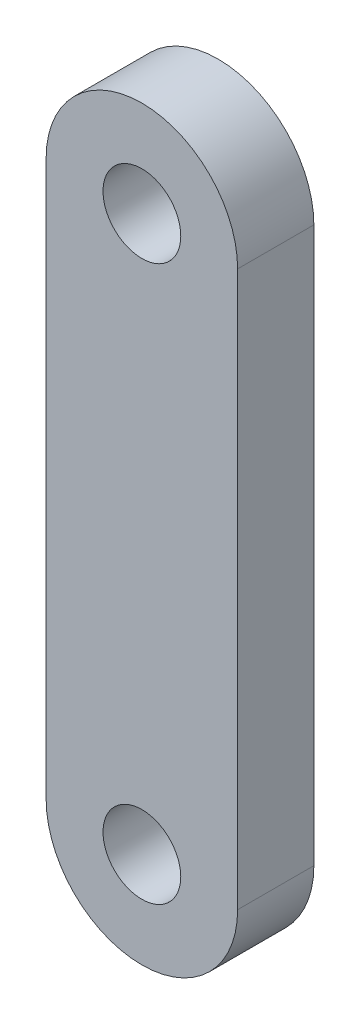
ISO-10303-21;
HEADER;
FILE_DESCRIPTION(('STEP AP214'),'2;1');
FILE_NAME('part.step','',(''),(''),'','','');
FILE_SCHEMA(('AUTOMOTIVE_DESIGN { 1 0 10303 214 1 1 1 1 }'));
ENDSEC;
DATA;
#1=APPLICATION_CONTEXT('core data for automotive mechanical design processes');
#2=APPLICATION_PROTOCOL_DEFINITION('international standard','automotive_design',2000,#1);
#3=PRODUCT_CONTEXT('',#1,'mechanical');
#4=PRODUCT('Part','Part','',(#3));
#5=PRODUCT_RELATED_PRODUCT_CATEGORY('part','',(#4));
#6=PRODUCT_DEFINITION_FORMATION('','',#4);
#7=PRODUCT_DEFINITION_CONTEXT('part definition',#1,'design');
#8=PRODUCT_DEFINITION('design','',#6,#7);
#9=PRODUCT_DEFINITION_SHAPE('','',#8);
#10=(LENGTH_UNIT() NAMED_UNIT(*) SI_UNIT(.MILLI.,.METRE.));
#11=(NAMED_UNIT(*) PLANE_ANGLE_UNIT() SI_UNIT($,.RADIAN.));
#12=(NAMED_UNIT(*) SI_UNIT($,.STERADIAN.) SOLID_ANGLE_UNIT());
#13=UNCERTAINTY_MEASURE_WITH_UNIT(LENGTH_MEASURE(1.E-05),#10,'distance_accuracy_value','');
#14=(GEOMETRIC_REPRESENTATION_CONTEXT(3) GLOBAL_UNCERTAINTY_ASSIGNED_CONTEXT((#13)) GLOBAL_UNIT_ASSIGNED_CONTEXT((#10,
#11,#12)) REPRESENTATION_CONTEXT('',''));
#15=CARTESIAN_POINT('',(0.,0.,0.));
#16=DIRECTION('',(0.,0.,1.));
#17=DIRECTION('',(1.,0.,0.));
#18=AXIS2_PLACEMENT_3D('',#15,#16,#17);
#19=CARTESIAN_POINT('',(0.,23.114,6.35));
#20=DIRECTION('',(0.,0.,1.));
#21=DIRECTION('',(1.,0.,0.));
#22=AXIS2_PLACEMENT_3D('',#19,#20,#21);
#23=PLANE('',#22);
#24=CARTESIAN_POINT('',(0.,23.114,6.35));
#25=DIRECTION('',(0.,0.,1.));
#26=DIRECTION('',(1.,0.,0.));
#27=AXIS2_PLACEMENT_3D('',#24,#25,#26);
#28=CIRCLE('',#27,3.2385);
#29=CARTESIAN_POINT('',(3.23849999999999,23.114,6.35));
#30=VERTEX_POINT('',#29);
#31=EDGE_CURVE('E99',#30,#30,#28,.T.);
#32=ORIENTED_EDGE('',*,*,#31,.F.);
#33=EDGE_LOOP('',(#32));
#34=FACE_BOUND('',#33,.T.);
#35=CARTESIAN_POINT('',(0.,23.114,6.35));
#36=DIRECTION('',(0.,0.,1.));
#37=DIRECTION('',(1.,0.,0.));
#38=AXIS2_PLACEMENT_3D('',#35,#36,#37);
#39=CIRCLE('',#38,7.9756);
#40=CARTESIAN_POINT('',(7.97559999999999,23.114,6.35));
#41=VERTEX_POINT('',#40);
#42=CARTESIAN_POINT('',(-7.97560000000001,23.114,6.35));
#43=VERTEX_POINT('',#42);
#44=EDGE_CURVE('E84',#41,#43,#39,.T.);
#45=ORIENTED_EDGE('',*,*,#44,.T.);
#46=DIRECTION('',(0.,-1.,0.));
#47=VECTOR('',#46,1.);
#48=CARTESIAN_POINT('',(-7.97560000000001,23.114,6.35));
#49=LINE('',#48,#47);
#50=CARTESIAN_POINT('',(-7.97559999999999,-23.114,6.35));
#51=VERTEX_POINT('',#50);
#52=EDGE_CURVE('E79',#43,#51,#49,.T.);
#53=ORIENTED_EDGE('',*,*,#52,.T.);
#54=CARTESIAN_POINT('',(0.,-23.114,6.35));
#55=DIRECTION('',(0.,0.,1.));
#56=DIRECTION('',(1.,0.,0.));
#57=AXIS2_PLACEMENT_3D('',#54,#55,#56);
#58=CIRCLE('',#57,7.9756);
#59=CARTESIAN_POINT('',(7.97560000000001,-23.114,6.35));
#60=VERTEX_POINT('',#59);
#61=EDGE_CURVE('E82',#51,#60,#58,.T.);
#62=ORIENTED_EDGE('',*,*,#61,.T.);
#63=DIRECTION('',(0.,1.,0.));
#64=VECTOR('',#63,1.);
#65=CARTESIAN_POINT('',(7.97559999999999,23.114,6.35));
#66=LINE('',#65,#64);
#67=EDGE_CURVE('E49',#60,#41,#66,.T.);
#68=ORIENTED_EDGE('',*,*,#67,.T.);
#69=EDGE_LOOP('',(#45,#53,#62,#68));
#70=FACE_BOUND('',#69,.T.);
#71=CARTESIAN_POINT('',(0.,-23.114,6.35));
#72=DIRECTION('',(0.,0.,1.));
#73=DIRECTION('',(1.,0.,0.));
#74=AXIS2_PLACEMENT_3D('',#71,#72,#73);
#75=CIRCLE('',#74,3.2385);
#76=CARTESIAN_POINT('',(3.23850000000001,-23.114,6.35));
#77=VERTEX_POINT('',#76);
#78=EDGE_CURVE('E114',#77,#77,#75,.T.);
#79=ORIENTED_EDGE('',*,*,#78,.F.);
#80=EDGE_LOOP('',(#79));
#81=FACE_BOUND('',#80,.T.);
#82=ADVANCED_FACE('F32',(#34,#70,#81),#23,.T.);
#83=CARTESIAN_POINT('',(0.,23.114,0.));
#84=DIRECTION('',(0.,0.,1.));
#85=DIRECTION('',(1.,0.,0.));
#86=AXIS2_PLACEMENT_3D('',#83,#84,#85);
#87=PLANE('',#86);
#88=CARTESIAN_POINT('',(0.,23.114,0.));
#89=DIRECTION('',(0.,0.,1.));
#90=DIRECTION('',(1.,0.,0.));
#91=AXIS2_PLACEMENT_3D('',#88,#89,#90);
#92=CIRCLE('',#91,7.9756);
#93=CARTESIAN_POINT('',(7.97559999999999,23.114,0.));
#94=VERTEX_POINT('',#93);
#95=CARTESIAN_POINT('',(-7.97560000000001,23.114,0.));
#96=VERTEX_POINT('',#95);
#97=EDGE_CURVE('E96',#94,#96,#92,.T.);
#98=ORIENTED_EDGE('',*,*,#97,.F.);
#99=DIRECTION('',(0.,1.,0.));
#100=VECTOR('',#99,1.);
#101=CARTESIAN_POINT('',(7.97559999999999,23.114,0.));
#102=LINE('',#101,#100);
#103=CARTESIAN_POINT('',(7.97560000000001,-23.114,0.));
#104=VERTEX_POINT('',#103);
#105=EDGE_CURVE('E72',#104,#94,#102,.T.);
#106=ORIENTED_EDGE('',*,*,#105,.F.);
#107=CARTESIAN_POINT('',(0.,-23.114,0.));
#108=DIRECTION('',(0.,0.,1.));
#109=DIRECTION('',(1.,0.,0.));
#110=AXIS2_PLACEMENT_3D('',#107,#108,#109);
#111=CIRCLE('',#110,7.9756);
#112=CARTESIAN_POINT('',(-7.97559999999999,-23.114,0.));
#113=VERTEX_POINT('',#112);
#114=EDGE_CURVE('E66',#113,#104,#111,.T.);
#115=ORIENTED_EDGE('',*,*,#114,.F.);
#116=DIRECTION('',(0.,-1.,0.));
#117=VECTOR('',#116,1.);
#118=CARTESIAN_POINT('',(-7.97560000000001,23.114,0.));
#119=LINE('',#118,#117);
#120=EDGE_CURVE('E88',#96,#113,#119,.T.);
#121=ORIENTED_EDGE('',*,*,#120,.F.);
#122=EDGE_LOOP('',(#98,#106,#115,#121));
#123=FACE_BOUND('',#122,.T.);
#124=CARTESIAN_POINT('',(0.,23.114,0.));
#125=DIRECTION('',(0.,0.,1.));
#126=DIRECTION('',(1.,0.,0.));
#127=AXIS2_PLACEMENT_3D('',#124,#125,#126);
#128=CIRCLE('',#127,3.2385);
#129=CARTESIAN_POINT('',(3.23849999999999,23.114,0.));
#130=VERTEX_POINT('',#129);
#131=EDGE_CURVE('E111',#130,#130,#128,.T.);
#132=ORIENTED_EDGE('',*,*,#131,.T.);
#133=EDGE_LOOP('',(#132));
#134=FACE_BOUND('',#133,.T.);
#135=CARTESIAN_POINT('',(0.,-23.114,0.));
#136=DIRECTION('',(0.,0.,1.));
#137=DIRECTION('',(1.,0.,0.));
#138=AXIS2_PLACEMENT_3D('',#135,#136,#137);
#139=CIRCLE('',#138,3.2385);
#140=CARTESIAN_POINT('',(3.23850000000001,-23.114,0.));
#141=VERTEX_POINT('',#140);
#142=EDGE_CURVE('E117',#141,#141,#139,.T.);
#143=ORIENTED_EDGE('',*,*,#142,.T.);
#144=EDGE_LOOP('',(#143));
#145=FACE_BOUND('',#144,.T.);
#146=ADVANCED_FACE('F107',(#123,#134,#145),#87,.F.);
#147=CARTESIAN_POINT('',(0.,23.114,6.35));
#148=DIRECTION('',(0.,0.,-1.));
#149=DIRECTION('',(-1.,0.,0.));
#150=AXIS2_PLACEMENT_3D('',#147,#148,#149);
#151=CYLINDRICAL_SURFACE('',#150,7.9756);
#152=ORIENTED_EDGE('',*,*,#97,.T.);
#153=DIRECTION('',(0.,0.,-1.));
#154=VECTOR('',#153,1.);
#155=CARTESIAN_POINT('',(-7.97560000000001,23.114,6.35));
#156=LINE('',#155,#154);
#157=EDGE_CURVE('E11',#43,#96,#156,.T.);
#158=ORIENTED_EDGE('',*,*,#157,.F.);
#159=ORIENTED_EDGE('',*,*,#44,.F.);
#160=DIRECTION('',(0.,0.,-1.));
#161=VECTOR('',#160,1.);
#162=CARTESIAN_POINT('',(7.97559999999999,23.114,6.35));
#163=LINE('',#162,#161);
#164=EDGE_CURVE('E92',#41,#94,#163,.T.);
#165=ORIENTED_EDGE('',*,*,#164,.T.);
#166=EDGE_LOOP('',(#152,#158,#159,#165));
#167=FACE_BOUND('',#166,.T.);
#168=ADVANCED_FACE('F34',(#167),#151,.T.);
#169=CARTESIAN_POINT('',(-7.97560000000001,23.114,6.35));
#170=DIRECTION('',(1.,0.,0.));
#171=DIRECTION('',(0.,1.,0.));
#172=AXIS2_PLACEMENT_3D('',#169,#170,#171);
#173=PLANE('',#172);
#174=ORIENTED_EDGE('',*,*,#120,.T.);
#175=DIRECTION('',(0.,0.,-1.));
#176=VECTOR('',#175,1.);
#177=CARTESIAN_POINT('',(-7.97559999999999,-23.114,6.35));
#178=LINE('',#177,#176);
#179=EDGE_CURVE('E41',#51,#113,#178,.T.);
#180=ORIENTED_EDGE('',*,*,#179,.F.);
#181=ORIENTED_EDGE('',*,*,#52,.F.);
#182=ORIENTED_EDGE('',*,*,#157,.T.);
#183=EDGE_LOOP('',(#174,#180,#181,#182));
#184=FACE_BOUND('',#183,.T.);
#185=ADVANCED_FACE('F87',(#184),#173,.F.);
#186=CARTESIAN_POINT('',(0.,-23.114,6.35));
#187=DIRECTION('',(0.,0.,-1.));
#188=DIRECTION('',(-1.,0.,0.));
#189=AXIS2_PLACEMENT_3D('',#186,#187,#188);
#190=CYLINDRICAL_SURFACE('',#189,7.9756);
#191=ORIENTED_EDGE('',*,*,#114,.T.);
#192=DIRECTION('',(0.,0.,-1.));
#193=VECTOR('',#192,1.);
#194=CARTESIAN_POINT('',(7.97560000000001,-23.114,6.35));
#195=LINE('',#194,#193);
#196=EDGE_CURVE('E89',#60,#104,#195,.T.);
#197=ORIENTED_EDGE('',*,*,#196,.F.);
#198=ORIENTED_EDGE('',*,*,#61,.F.);
#199=ORIENTED_EDGE('',*,*,#179,.T.);
#200=EDGE_LOOP('',(#191,#197,#198,#199));
#201=FACE_BOUND('',#200,.T.);
#202=ADVANCED_FACE('F90',(#201),#190,.T.);
#203=CARTESIAN_POINT('',(7.97559999999999,23.114,6.35));
#204=DIRECTION('',(-1.,0.,0.));
#205=DIRECTION('',(0.,-1.,0.));
#206=AXIS2_PLACEMENT_3D('',#203,#204,#205);
#207=PLANE('',#206);
#208=ORIENTED_EDGE('',*,*,#105,.T.);
#209=ORIENTED_EDGE('',*,*,#164,.F.);
#210=ORIENTED_EDGE('',*,*,#67,.F.);
#211=ORIENTED_EDGE('',*,*,#196,.T.);
#212=EDGE_LOOP('',(#208,#209,#210,#211));
#213=FACE_BOUND('',#212,.T.);
#214=ADVANCED_FACE('F104',(#213),#207,.F.);
#215=CARTESIAN_POINT('',(0.,23.114,6.35));
#216=DIRECTION('',(0.,0.,-1.));
#217=DIRECTION('',(-1.,0.,0.));
#218=AXIS2_PLACEMENT_3D('',#215,#216,#217);
#219=CYLINDRICAL_SURFACE('',#218,3.2385);
#220=ORIENTED_EDGE('',*,*,#31,.T.);
#221=EDGE_LOOP('',(#220));
#222=FACE_BOUND('',#221,.T.);
#223=ORIENTED_EDGE('',*,*,#131,.F.);
#224=EDGE_LOOP('',(#223));
#225=FACE_BOUND('',#224,.T.);
#226=ADVANCED_FACE('F134',(#222,#225),#219,.F.);
#227=CARTESIAN_POINT('',(0.,-23.114,6.35));
#228=DIRECTION('',(0.,0.,-1.));
#229=DIRECTION('',(-1.,0.,0.));
#230=AXIS2_PLACEMENT_3D('',#227,#228,#229);
#231=CYLINDRICAL_SURFACE('',#230,3.2385);
#232=ORIENTED_EDGE('',*,*,#78,.T.);
#233=EDGE_LOOP('',(#232));
#234=FACE_BOUND('',#233,.T.);
#235=ORIENTED_EDGE('',*,*,#142,.F.);
#236=EDGE_LOOP('',(#235));
#237=FACE_BOUND('',#236,.T.);
#238=ADVANCED_FACE('F123',(#234,#237),#231,.F.);
#239=CLOSED_SHELL('',(#82,#146,#168,#185,#202,#214,#226,#238));
#240=MANIFOLD_SOLID_BREP('B2',#239);
#241=ADVANCED_BREP_SHAPE_REPRESENTATION('',(#18,#240),#14);
#242=SHAPE_DEFINITION_REPRESENTATION(#9,#241);
ENDSEC;
END-ISO-10303-21;
